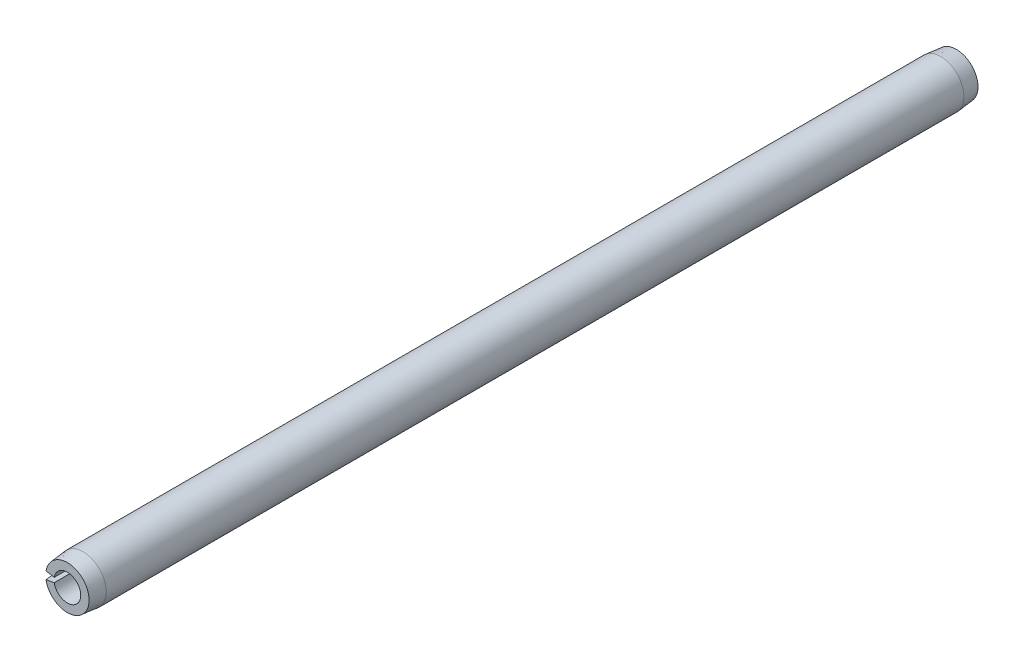
ISO-10303-21;
HEADER;
FILE_DESCRIPTION(('STEP AP214'),'2;1');
FILE_NAME('part.step','',(''),(''),'','','');
FILE_SCHEMA(('AUTOMOTIVE_DESIGN { 1 0 10303 214 1 1 1 1 }'));
ENDSEC;
DATA;
#1=APPLICATION_CONTEXT('core data for automotive mechanical design processes');
#2=APPLICATION_PROTOCOL_DEFINITION('international standard','automotive_design',2000,#1);
#3=PRODUCT_CONTEXT('',#1,'mechanical');
#4=PRODUCT('Part','Part','',(#3));
#5=PRODUCT_RELATED_PRODUCT_CATEGORY('part','',(#4));
#6=PRODUCT_DEFINITION_FORMATION('','',#4);
#7=PRODUCT_DEFINITION_CONTEXT('part definition',#1,'design');
#8=PRODUCT_DEFINITION('design','',#6,#7);
#9=PRODUCT_DEFINITION_SHAPE('','',#8);
#10=(LENGTH_UNIT() NAMED_UNIT(*) SI_UNIT(.MILLI.,.METRE.));
#11=(NAMED_UNIT(*) PLANE_ANGLE_UNIT() SI_UNIT($,.RADIAN.));
#12=(NAMED_UNIT(*) SI_UNIT($,.STERADIAN.) SOLID_ANGLE_UNIT());
#13=UNCERTAINTY_MEASURE_WITH_UNIT(LENGTH_MEASURE(1.E-05),#10,'distance_accuracy_value','');
#14=(GEOMETRIC_REPRESENTATION_CONTEXT(3) GLOBAL_UNCERTAINTY_ASSIGNED_CONTEXT((#13)) GLOBAL_UNIT_ASSIGNED_CONTEXT((#10,
#11,#12)) REPRESENTATION_CONTEXT('',''));
#15=CARTESIAN_POINT('',(0.,0.,0.));
#16=DIRECTION('',(0.,0.,1.));
#17=DIRECTION('',(1.,0.,0.));
#18=AXIS2_PLACEMENT_3D('',#15,#16,#17);
#19=CARTESIAN_POINT('',(0.,0.,31.75));
#20=DIRECTION('',(0.,0.,-1.));
#21=DIRECTION('',(-1.,0.,0.));
#22=AXIS2_PLACEMENT_3D('',#19,#20,#21);
#23=CYLINDRICAL_SURFACE('',#22,0.9525);
#24=CARTESIAN_POINT('',(0.,0.,-31.75));
#25=DIRECTION('',(0.,0.,-1.));
#26=DIRECTION('',(1.,0.,0.));
#27=AXIS2_PLACEMENT_3D('',#24,#25,#26);
#28=CIRCLE('',#27,0.9525);
#29=CARTESIAN_POINT('',(-0.938029384744128,0.165399889227748,-31.75));
#30=VERTEX_POINT('',#29);
#31=CARTESIAN_POINT('',(-0.938029384744128,-0.165399889227748,-31.75));
#32=VERTEX_POINT('',#31);
#33=EDGE_CURVE('E115',#30,#32,#28,.T.);
#34=ORIENTED_EDGE('',*,*,#33,.T.);
#35=DIRECTION('',(0.,0.,-1.));
#36=VECTOR('',#35,1.);
#37=CARTESIAN_POINT('',(-0.938029384744128,-0.165399889227748,31.75));
#38=LINE('',#37,#36);
#39=CARTESIAN_POINT('',(-0.938029384744128,-0.165399889227748,31.75));
#40=VERTEX_POINT('',#39);
#41=EDGE_CURVE('E11',#40,#32,#38,.T.);
#42=ORIENTED_EDGE('',*,*,#41,.F.);
#43=CARTESIAN_POINT('',(0.,0.,31.75));
#44=DIRECTION('',(0.,0.,-1.));
#45=DIRECTION('',(1.,0.,0.));
#46=AXIS2_PLACEMENT_3D('',#43,#44,#45);
#47=CIRCLE('',#46,0.9525);
#48=CARTESIAN_POINT('',(-0.938029384744128,0.165399889227748,31.75));
#49=VERTEX_POINT('',#48);
#50=EDGE_CURVE('E111',#49,#40,#47,.T.);
#51=ORIENTED_EDGE('',*,*,#50,.F.);
#52=DIRECTION('',(0.,0.,-1.));
#53=VECTOR('',#52,1.);
#54=CARTESIAN_POINT('',(-0.938029384744128,0.165399889227748,31.75));
#55=LINE('',#54,#53);
#56=EDGE_CURVE('E104',#49,#30,#55,.T.);
#57=ORIENTED_EDGE('',*,*,#56,.T.);
#58=EDGE_LOOP('',(#34,#42,#51,#57));
#59=FACE_BOUND('',#58,.T.);
#60=ADVANCED_FACE('F32',(#59),#23,.F.);
#61=CARTESIAN_POINT('',(-0.938029384744128,-0.165399889227748,31.75));
#62=DIRECTION('',(0.173648177666927,-0.984807753012209,0.));
#63=DIRECTION('',(0.984807753012209,0.173648177666927,0.));
#64=AXIS2_PLACEMENT_3D('',#61,#62,#63);
#65=PLANE('',#64);
#66=DIRECTION('',(0.,0.,-1.));
#67=VECTOR('',#66,1.);
#68=CARTESIAN_POINT('',(-1.63842465868641,-0.288898473184466,31.75));
#69=LINE('',#68,#67);
#70=CARTESIAN_POINT('',(-1.63842465868642,-0.288898473184467,30.6324));
#71=VERTEX_POINT('',#70);
#72=CARTESIAN_POINT('',(-1.63842465868642,-0.288898473184467,-30.6324));
#73=VERTEX_POINT('',#72);
#74=EDGE_CURVE('E39',#71,#73,#69,.T.);
#75=ORIENTED_EDGE('',*,*,#74,.F.);
#76=DIRECTION('',(-0.100196325582815,-0.0176673155680997,-0.99481081734183));
#77=VECTOR('',#76,1.);
#78=CARTESIAN_POINT('',(0.,0.,46.8996888888892));
#79=LINE('',#78,#77);
#80=CARTESIAN_POINT('',(-1.52586113251712,-0.269050486477139,31.75));
#81=VERTEX_POINT('',#80);
#82=EDGE_CURVE('E86',#71,#81,#79,.F.);
#83=ORIENTED_EDGE('',*,*,#82,.T.);
#84=DIRECTION('',(-0.984807753012209,-0.173648177666927,0.));
#85=VECTOR('',#84,1.);
#86=CARTESIAN_POINT('',(-0.938029384744128,-0.165399889227748,31.75));
#87=LINE('',#86,#85);
#88=EDGE_CURVE('E119',#40,#81,#87,.T.);
#89=ORIENTED_EDGE('',*,*,#88,.F.);
#90=ORIENTED_EDGE('',*,*,#41,.T.);
#91=DIRECTION('',(-0.984807753012209,-0.173648177666927,0.));
#92=VECTOR('',#91,1.);
#93=CARTESIAN_POINT('',(-0.938029384744128,-0.165399889227748,-31.75));
#94=LINE('',#93,#92);
#95=CARTESIAN_POINT('',(-1.52586113251712,-0.269050486477138,-31.75));
#96=VERTEX_POINT('',#95);
#97=EDGE_CURVE('E112',#32,#96,#94,.T.);
#98=ORIENTED_EDGE('',*,*,#97,.T.);
#99=DIRECTION('',(0.100196325582814,0.0176673155680997,-0.99481081734183));
#100=VECTOR('',#99,1.);
#101=CARTESIAN_POINT('',(0.,0.,-46.8996888888892));
#102=LINE('',#101,#100);
#103=EDGE_CURVE('E54',#96,#73,#102,.F.);
#104=ORIENTED_EDGE('',*,*,#103,.T.);
#105=EDGE_LOOP('',(#75,#83,#89,#90,#98,#104));
#106=FACE_BOUND('',#105,.T.);
#107=ADVANCED_FACE('F133',(#106),#65,.F.);
#108=CARTESIAN_POINT('',(0.,0.,31.75));
#109=DIRECTION('',(0.,0.,-1.));
#110=DIRECTION('',(-1.,0.,0.));
#111=AXIS2_PLACEMENT_3D('',#108,#109,#110);
#112=CYLINDRICAL_SURFACE('',#111,1.6637);
#113=DIRECTION('',(0.,0.,-1.));
#114=VECTOR('',#113,1.);
#115=CARTESIAN_POINT('',(-1.63842465868641,0.288898473184467,31.75));
#116=LINE('',#115,#114);
#117=CARTESIAN_POINT('',(-1.63842465868642,0.288898473184468,30.6324));
#118=VERTEX_POINT('',#117);
#119=CARTESIAN_POINT('',(-1.63842465868642,0.288898473184467,-30.6324));
#120=VERTEX_POINT('',#119);
#121=EDGE_CURVE('E96',#118,#120,#116,.T.);
#122=ORIENTED_EDGE('',*,*,#121,.F.);
#123=CARTESIAN_POINT('',(0.,0.,30.6324));
#124=DIRECTION('',(0.,0.,-1.));
#125=DIRECTION('',(-1.,0.,0.));
#126=AXIS2_PLACEMENT_3D('',#123,#124,#125);
#127=CIRCLE('',#126,1.66370000000001);
#128=EDGE_CURVE('E83',#118,#71,#127,.T.);
#129=ORIENTED_EDGE('',*,*,#128,.T.);
#130=ORIENTED_EDGE('',*,*,#74,.T.);
#131=CARTESIAN_POINT('',(0.,0.,-30.6324));
#132=DIRECTION('',(0.,0.,-1.));
#133=DIRECTION('',(-1.,0.,0.));
#134=AXIS2_PLACEMENT_3D('',#131,#132,#133);
#135=CIRCLE('',#134,1.66370000000001);
#136=EDGE_CURVE('E103',#120,#73,#135,.T.);
#137=ORIENTED_EDGE('',*,*,#136,.F.);
#138=EDGE_LOOP('',(#122,#129,#130,#137));
#139=FACE_BOUND('',#138,.T.);
#140=ADVANCED_FACE('F102',(#139),#112,.T.);
#141=CARTESIAN_POINT('',(-1.63842465868641,0.288898473184467,31.75));
#142=DIRECTION('',(0.173648177666927,0.984807753012209,0.));
#143=DIRECTION('',(-0.984807753012209,0.173648177666927,0.));
#144=AXIS2_PLACEMENT_3D('',#141,#142,#143);
#145=PLANE('',#144);
#146=DIRECTION('',(0.984807753012209,-0.173648177666927,0.));
#147=VECTOR('',#146,1.);
#148=CARTESIAN_POINT('',(-1.63842465868641,0.288898473184467,31.75));
#149=LINE('',#148,#147);
#150=CARTESIAN_POINT('',(-1.52586113251712,0.269050486477138,31.75));
#151=VERTEX_POINT('',#150);
#152=EDGE_CURVE('E99',#151,#49,#149,.T.);
#153=ORIENTED_EDGE('',*,*,#152,.F.);
#154=DIRECTION('',(0.100196325582815,-0.0176673155680997,0.99481081734183));
#155=VECTOR('',#154,1.);
#156=CARTESIAN_POINT('',(0.,0.,46.8996888888892));
#157=LINE('',#156,#155);
#158=EDGE_CURVE('E46',#151,#118,#157,.F.);
#159=ORIENTED_EDGE('',*,*,#158,.T.);
#160=ORIENTED_EDGE('',*,*,#121,.T.);
#161=DIRECTION('',(-0.100196325582814,0.0176673155680997,0.99481081734183));
#162=VECTOR('',#161,1.);
#163=CARTESIAN_POINT('',(0.,0.,-46.8996888888892));
#164=LINE('',#163,#162);
#165=CARTESIAN_POINT('',(-1.52586113251712,0.269050486477138,-31.75));
#166=VERTEX_POINT('',#165);
#167=EDGE_CURVE('E125',#120,#166,#164,.F.);
#168=ORIENTED_EDGE('',*,*,#167,.T.);
#169=DIRECTION('',(0.984807753012209,-0.173648177666927,0.));
#170=VECTOR('',#169,1.);
#171=CARTESIAN_POINT('',(-1.63842465868641,0.288898473184467,-31.75));
#172=LINE('',#171,#170);
#173=EDGE_CURVE('E109',#166,#30,#172,.T.);
#174=ORIENTED_EDGE('',*,*,#173,.T.);
#175=ORIENTED_EDGE('',*,*,#56,.F.);
#176=EDGE_LOOP('',(#153,#159,#160,#168,#174,#175));
#177=FACE_BOUND('',#176,.T.);
#178=ADVANCED_FACE('F94',(#177),#145,.F.);
#179=CARTESIAN_POINT('',(0.,0.,31.75));
#180=DIRECTION('',(0.,0.,1.));
#181=DIRECTION('',(1.,0.,0.));
#182=AXIS2_PLACEMENT_3D('',#179,#180,#181);
#183=PLANE('',#182);
#184=CARTESIAN_POINT('',(0.,0.,31.75));
#185=DIRECTION('',(0.,0.,-1.));
#186=DIRECTION('',(-1.,0.,0.));
#187=AXIS2_PLACEMENT_3D('',#184,#185,#186);
#188=CIRCLE('',#187,1.54940000000001);
#189=EDGE_CURVE('E90',#151,#81,#188,.T.);
#190=ORIENTED_EDGE('',*,*,#189,.F.);
#191=ORIENTED_EDGE('',*,*,#152,.T.);
#192=ORIENTED_EDGE('',*,*,#50,.T.);
#193=ORIENTED_EDGE('',*,*,#88,.T.);
#194=EDGE_LOOP('',(#190,#191,#192,#193));
#195=FACE_BOUND('',#194,.T.);
#196=ADVANCED_FACE('F134',(#195),#183,.T.);
#197=CARTESIAN_POINT('',(0.,0.,-31.75));
#198=DIRECTION('',(0.,0.,1.));
#199=DIRECTION('',(1.,0.,0.));
#200=AXIS2_PLACEMENT_3D('',#197,#198,#199);
#201=PLANE('',#200);
#202=ORIENTED_EDGE('',*,*,#173,.F.);
#203=CARTESIAN_POINT('',(0.,0.,-31.75));
#204=DIRECTION('',(0.,0.,-1.));
#205=DIRECTION('',(-1.,0.,0.));
#206=AXIS2_PLACEMENT_3D('',#203,#204,#205);
#207=CIRCLE('',#206,1.54940000000001);
#208=EDGE_CURVE('E127',#166,#96,#207,.T.);
#209=ORIENTED_EDGE('',*,*,#208,.T.);
#210=ORIENTED_EDGE('',*,*,#97,.F.);
#211=ORIENTED_EDGE('',*,*,#33,.F.);
#212=EDGE_LOOP('',(#202,#209,#210,#211));
#213=FACE_BOUND('',#212,.T.);
#214=ADVANCED_FACE('F141',(#213),#201,.F.);
#215=CARTESIAN_POINT('',(0.,0.,-30.6324));
#216=DIRECTION('',(0.,0.,1.));
#217=DIRECTION('',(1.,0.,0.));
#218=AXIS2_PLACEMENT_3D('',#215,#216,#217);
#219=CONICAL_SURFACE('',#218,1.66370000000001,0.101918367480872);
#220=ORIENTED_EDGE('',*,*,#208,.F.);
#221=ORIENTED_EDGE('',*,*,#167,.F.);
#222=ORIENTED_EDGE('',*,*,#136,.T.);
#223=ORIENTED_EDGE('',*,*,#103,.F.);
#224=EDGE_LOOP('',(#220,#221,#222,#223));
#225=FACE_BOUND('',#224,.T.);
#226=ADVANCED_FACE('F142',(#225),#219,.T.);
#227=CARTESIAN_POINT('',(0.,0.,31.75));
#228=DIRECTION('',(0.,0.,-1.));
#229=DIRECTION('',(-1.,0.,0.));
#230=AXIS2_PLACEMENT_3D('',#227,#228,#229);
#231=CONICAL_SURFACE('',#230,1.54940000000001,0.101918367480872);
#232=ORIENTED_EDGE('',*,*,#128,.F.);
#233=ORIENTED_EDGE('',*,*,#158,.F.);
#234=ORIENTED_EDGE('',*,*,#189,.T.);
#235=ORIENTED_EDGE('',*,*,#82,.F.);
#236=EDGE_LOOP('',(#232,#233,#234,#235));
#237=FACE_BOUND('',#236,.T.);
#238=ADVANCED_FACE('F84',(#237),#231,.T.);
#239=CLOSED_SHELL('',(#60,#107,#140,#178,#196,#214,#226,#238));
#240=MANIFOLD_SOLID_BREP('B2',#239);
#241=ADVANCED_BREP_SHAPE_REPRESENTATION('',(#18,#240),#14);
#242=SHAPE_DEFINITION_REPRESENTATION(#9,#241);
ENDSEC;
END-ISO-10303-21;
